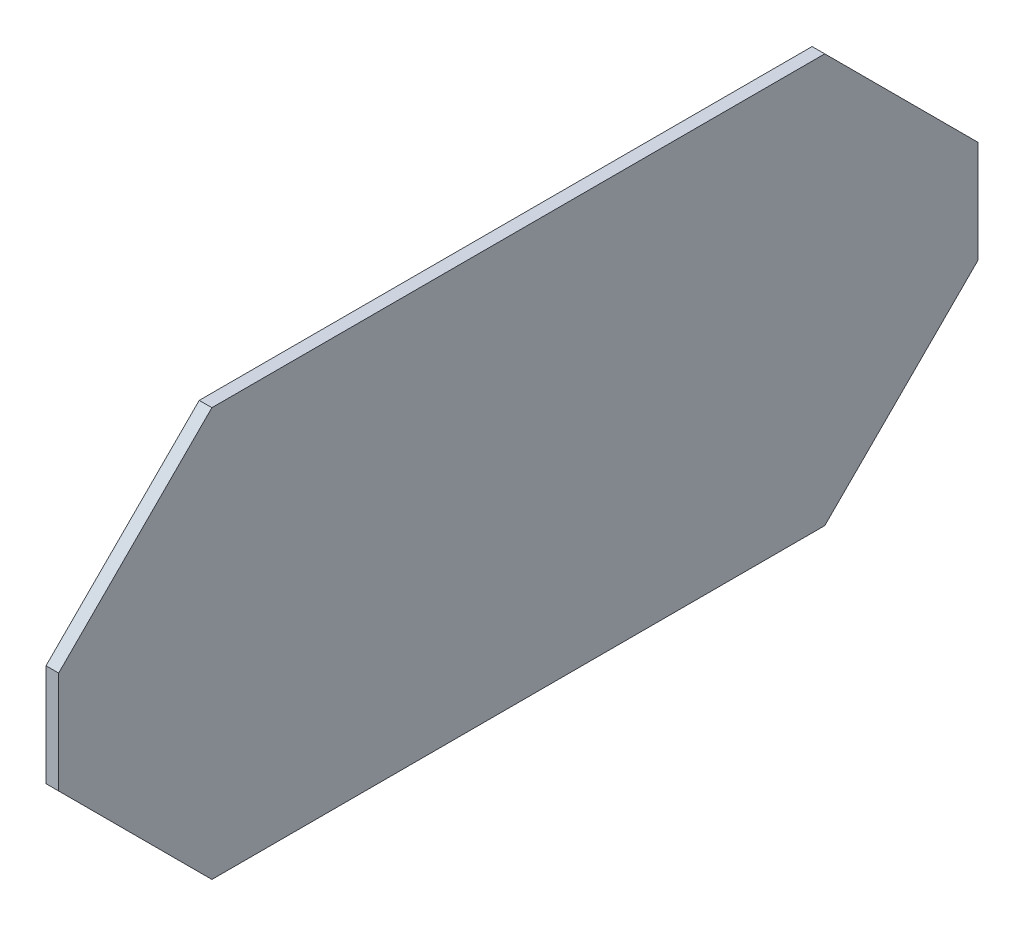
ISO-10303-21;
HEADER;
FILE_DESCRIPTION(('STEP AP214'),'2;1');
FILE_NAME('part.step','',(''),(''),'','','');
FILE_SCHEMA(('AUTOMOTIVE_DESIGN { 1 0 10303 214 1 1 1 1 }'));
ENDSEC;
DATA;
#1=APPLICATION_CONTEXT('core data for automotive mechanical design processes');
#2=APPLICATION_PROTOCOL_DEFINITION('international standard','automotive_design',2000,#1);
#3=PRODUCT_CONTEXT('',#1,'mechanical');
#4=PRODUCT('Part','Part','',(#3));
#5=PRODUCT_RELATED_PRODUCT_CATEGORY('part','',(#4));
#6=PRODUCT_DEFINITION_FORMATION('','',#4);
#7=PRODUCT_DEFINITION_CONTEXT('part definition',#1,'design');
#8=PRODUCT_DEFINITION('design','',#6,#7);
#9=PRODUCT_DEFINITION_SHAPE('','',#8);
#10=(LENGTH_UNIT() NAMED_UNIT(*) SI_UNIT(.MILLI.,.METRE.));
#11=(NAMED_UNIT(*) PLANE_ANGLE_UNIT() SI_UNIT($,.RADIAN.));
#12=(NAMED_UNIT(*) SI_UNIT($,.STERADIAN.) SOLID_ANGLE_UNIT());
#13=UNCERTAINTY_MEASURE_WITH_UNIT(LENGTH_MEASURE(1.E-05),#10,'distance_accuracy_value','');
#14=(GEOMETRIC_REPRESENTATION_CONTEXT(3) GLOBAL_UNCERTAINTY_ASSIGNED_CONTEXT((#13)) GLOBAL_UNIT_ASSIGNED_CONTEXT((#10,
#11,#12)) REPRESENTATION_CONTEXT('',''));
#15=CARTESIAN_POINT('',(0.,0.,0.));
#16=DIRECTION('',(0.,0.,1.));
#17=DIRECTION('',(1.,0.,0.));
#18=AXIS2_PLACEMENT_3D('',#15,#16,#17);
#19=CARTESIAN_POINT('',(0.393699999999998,12.7,28.575));
#20=DIRECTION('',(-1.,0.,0.));
#21=DIRECTION('',(0.,-1.,0.));
#22=AXIS2_PLACEMENT_3D('',#19,#20,#21);
#23=PLANE('',#22);
#24=DIRECTION('',(0.,1.,0.));
#25=VECTOR('',#24,1.);
#26=CARTESIAN_POINT('',(0.393699999999998,12.7,-28.575));
#27=LINE('',#26,#25);
#28=CARTESIAN_POINT('',(0.3937,-3.17499999999996,-28.575));
#29=VERTEX_POINT('',#28);
#30=CARTESIAN_POINT('',(0.3937,3.17499999999997,-28.575));
#31=VERTEX_POINT('',#30);
#32=EDGE_CURVE('E159',#29,#31,#27,.T.);
#33=ORIENTED_EDGE('',*,*,#32,.T.);
#34=DIRECTION('',(0.,-0.707106781186549,-0.707106781186546));
#35=VECTOR('',#34,1.);
#36=CARTESIAN_POINT('',(0.393699999999998,12.7,-19.05));
#37=LINE('',#36,#35);
#38=CARTESIAN_POINT('',(0.393699999999998,12.7,-19.05));
#39=VERTEX_POINT('',#38);
#40=EDGE_CURVE('E144',#31,#39,#37,.F.);
#41=ORIENTED_EDGE('',*,*,#40,.T.);
#42=DIRECTION('',(0.,0.,-1.));
#43=VECTOR('',#42,1.);
#44=CARTESIAN_POINT('',(0.393699999999998,12.7,28.575));
#45=LINE('',#44,#43);
#46=CARTESIAN_POINT('',(0.393699999999998,12.7,19.05));
#47=VERTEX_POINT('',#46);
#48=EDGE_CURVE('E123',#47,#39,#45,.T.);
#49=ORIENTED_EDGE('',*,*,#48,.F.);
#50=DIRECTION('',(0.,-0.707106781186546,0.707106781186549));
#51=VECTOR('',#50,1.);
#52=CARTESIAN_POINT('',(0.3937,3.175,28.575));
#53=LINE('',#52,#51);
#54=CARTESIAN_POINT('',(0.3937,3.175,28.575));
#55=VERTEX_POINT('',#54);
#56=EDGE_CURVE('E127',#47,#55,#53,.T.);
#57=ORIENTED_EDGE('',*,*,#56,.T.);
#58=DIRECTION('',(0.,1.,0.));
#59=VECTOR('',#58,1.);
#60=CARTESIAN_POINT('',(0.393699999999998,12.7,28.575));
#61=LINE('',#60,#59);
#62=CARTESIAN_POINT('',(0.3937,-3.17499999999999,28.575));
#63=VERTEX_POINT('',#62);
#64=EDGE_CURVE('E153',#63,#55,#61,.T.);
#65=ORIENTED_EDGE('',*,*,#64,.F.);
#66=DIRECTION('',(0.,-0.707106781186546,-0.707106781186549));
#67=VECTOR('',#66,1.);
#68=CARTESIAN_POINT('',(0.3937,-3.17499999999999,28.575));
#69=LINE('',#68,#67);
#70=CARTESIAN_POINT('',(0.393700000000002,-12.7,19.05));
#71=VERTEX_POINT('',#70);
#72=EDGE_CURVE('E59',#63,#71,#69,.T.);
#73=ORIENTED_EDGE('',*,*,#72,.T.);
#74=DIRECTION('',(0.,0.,-1.));
#75=VECTOR('',#74,1.);
#76=CARTESIAN_POINT('',(0.393700000000002,-12.7,28.575));
#77=LINE('',#76,#75);
#78=CARTESIAN_POINT('',(0.393700000000002,-12.7,-19.05));
#79=VERTEX_POINT('',#78);
#80=EDGE_CURVE('E156',#71,#79,#77,.T.);
#81=ORIENTED_EDGE('',*,*,#80,.T.);
#82=DIRECTION('',(0.,-0.707106781186549,0.707106781186546));
#83=VECTOR('',#82,1.);
#84=CARTESIAN_POINT('',(0.393700000000002,-12.7,-19.05));
#85=LINE('',#84,#83);
#86=EDGE_CURVE('E51',#79,#29,#85,.F.);
#87=ORIENTED_EDGE('',*,*,#86,.T.);
#88=EDGE_LOOP('',(#33,#41,#49,#57,#65,#73,#81,#87));
#89=FACE_BOUND('',#88,.T.);
#90=ADVANCED_FACE('F35',(#89),#23,.F.);
#91=CARTESIAN_POINT('',(-0.393700000000001,12.7,28.575));
#92=DIRECTION('',(0.,-1.,0.));
#93=DIRECTION('',(0.,0.,-1.));
#94=AXIS2_PLACEMENT_3D('',#91,#92,#93);
#95=PLANE('',#94);
#96=ORIENTED_EDGE('',*,*,#48,.T.);
#97=DIRECTION('',(-1.,0.,0.));
#98=VECTOR('',#97,1.);
#99=CARTESIAN_POINT('',(-0.393700000000001,12.7,-19.05));
#100=LINE('',#99,#98);
#101=CARTESIAN_POINT('',(-0.393700000000001,12.7,-19.05));
#102=VERTEX_POINT('',#101);
#103=EDGE_CURVE('E114',#39,#102,#100,.T.);
#104=ORIENTED_EDGE('',*,*,#103,.T.);
#105=DIRECTION('',(0.,0.,-1.));
#106=VECTOR('',#105,1.);
#107=CARTESIAN_POINT('',(-0.393700000000001,12.7,28.575));
#108=LINE('',#107,#106);
#109=CARTESIAN_POINT('',(-0.393700000000001,12.7,19.05));
#110=VERTEX_POINT('',#109);
#111=EDGE_CURVE('E106',#110,#102,#108,.T.);
#112=ORIENTED_EDGE('',*,*,#111,.F.);
#113=DIRECTION('',(1.,0.,0.));
#114=VECTOR('',#113,1.);
#115=CARTESIAN_POINT('',(0.393699999999998,12.7,19.05));
#116=LINE('',#115,#114);
#117=EDGE_CURVE('E120',#110,#47,#116,.T.);
#118=ORIENTED_EDGE('',*,*,#117,.T.);
#119=EDGE_LOOP('',(#96,#104,#112,#118));
#120=FACE_BOUND('',#119,.T.);
#121=ADVANCED_FACE('F119',(#120),#95,.F.);
#122=CARTESIAN_POINT('',(-0.393700000000001,12.7,28.575));
#123=DIRECTION('',(1.,0.,0.));
#124=DIRECTION('',(0.,1.,0.));
#125=AXIS2_PLACEMENT_3D('',#122,#123,#124);
#126=PLANE('',#125);
#127=ORIENTED_EDGE('',*,*,#111,.T.);
#128=DIRECTION('',(0.,0.707106781186549,0.707106781186546));
#129=VECTOR('',#128,1.);
#130=CARTESIAN_POINT('',(-0.393700000000001,12.7,-19.05));
#131=LINE('',#130,#129);
#132=CARTESIAN_POINT('',(-0.3937,3.17499999999997,-28.575));
#133=VERTEX_POINT('',#132);
#134=EDGE_CURVE('E135',#102,#133,#131,.F.);
#135=ORIENTED_EDGE('',*,*,#134,.T.);
#136=DIRECTION('',(0.,-1.,0.));
#137=VECTOR('',#136,1.);
#138=CARTESIAN_POINT('',(-0.393700000000001,12.7,-28.575));
#139=LINE('',#138,#137);
#140=CARTESIAN_POINT('',(-0.3937,-3.17499999999996,-28.575));
#141=VERTEX_POINT('',#140);
#142=EDGE_CURVE('E154',#133,#141,#139,.T.);
#143=ORIENTED_EDGE('',*,*,#142,.T.);
#144=DIRECTION('',(0.,0.707106781186549,-0.707106781186546));
#145=VECTOR('',#144,1.);
#146=CARTESIAN_POINT('',(-0.393699999999998,-12.7,-19.05));
#147=LINE('',#146,#145);
#148=CARTESIAN_POINT('',(-0.393699999999998,-12.7,-19.05));
#149=VERTEX_POINT('',#148);
#150=EDGE_CURVE('E133',#141,#149,#147,.F.);
#151=ORIENTED_EDGE('',*,*,#150,.T.);
#152=DIRECTION('',(0.,0.,-1.));
#153=VECTOR('',#152,1.);
#154=CARTESIAN_POINT('',(-0.393699999999998,-12.7,28.575));
#155=LINE('',#154,#153);
#156=CARTESIAN_POINT('',(-0.393699999999998,-12.7,19.05));
#157=VERTEX_POINT('',#156);
#158=EDGE_CURVE('E124',#157,#149,#155,.T.);
#159=ORIENTED_EDGE('',*,*,#158,.F.);
#160=DIRECTION('',(0.,0.707106781186546,0.707106781186549));
#161=VECTOR('',#160,1.);
#162=CARTESIAN_POINT('',(-0.3937,-3.17499999999999,28.575));
#163=LINE('',#162,#161);
#164=CARTESIAN_POINT('',(-0.3937,-3.17499999999999,28.575));
#165=VERTEX_POINT('',#164);
#166=EDGE_CURVE('E113',#157,#165,#163,.T.);
#167=ORIENTED_EDGE('',*,*,#166,.T.);
#168=DIRECTION('',(0.,-1.,0.));
#169=VECTOR('',#168,1.);
#170=CARTESIAN_POINT('',(-0.393700000000001,12.7,28.575));
#171=LINE('',#170,#169);
#172=CARTESIAN_POINT('',(-0.3937,3.175,28.575));
#173=VERTEX_POINT('',#172);
#174=EDGE_CURVE('E108',#173,#165,#171,.T.);
#175=ORIENTED_EDGE('',*,*,#174,.F.);
#176=DIRECTION('',(0.,0.707106781186546,-0.707106781186549));
#177=VECTOR('',#176,1.);
#178=CARTESIAN_POINT('',(-0.3937,3.175,28.575));
#179=LINE('',#178,#177);
#180=EDGE_CURVE('E103',#173,#110,#179,.T.);
#181=ORIENTED_EDGE('',*,*,#180,.T.);
#182=EDGE_LOOP('',(#127,#135,#143,#151,#159,#167,#175,#181));
#183=FACE_BOUND('',#182,.T.);
#184=ADVANCED_FACE('F105',(#183),#126,.F.);
#185=CARTESIAN_POINT('',(-0.393699999999998,-12.7,28.575));
#186=DIRECTION('',(0.,1.,0.));
#187=DIRECTION('',(0.,0.,1.));
#188=AXIS2_PLACEMENT_3D('',#185,#186,#187);
#189=PLANE('',#188);
#190=ORIENTED_EDGE('',*,*,#158,.T.);
#191=DIRECTION('',(1.,0.,0.));
#192=VECTOR('',#191,1.);
#193=CARTESIAN_POINT('',(-0.393699999999998,-12.7,-19.05));
#194=LINE('',#193,#192);
#195=EDGE_CURVE('E148',#149,#79,#194,.T.);
#196=ORIENTED_EDGE('',*,*,#195,.T.);
#197=ORIENTED_EDGE('',*,*,#80,.F.);
#198=DIRECTION('',(-1.,0.,0.));
#199=VECTOR('',#198,1.);
#200=CARTESIAN_POINT('',(-0.393699999999998,-12.7,19.05));
#201=LINE('',#200,#199);
#202=EDGE_CURVE('E146',#71,#157,#201,.T.);
#203=ORIENTED_EDGE('',*,*,#202,.T.);
#204=EDGE_LOOP('',(#190,#196,#197,#203));
#205=FACE_BOUND('',#204,.T.);
#206=ADVANCED_FACE('F168',(#205),#189,.F.);
#207=CARTESIAN_POINT('',(0.,0.,28.575));
#208=DIRECTION('',(0.,0.,1.));
#209=DIRECTION('',(1.,0.,0.));
#210=AXIS2_PLACEMENT_3D('',#207,#208,#209);
#211=PLANE('',#210);
#212=ORIENTED_EDGE('',*,*,#174,.T.);
#213=DIRECTION('',(1.,0.,0.));
#214=VECTOR('',#213,1.);
#215=CARTESIAN_POINT('',(0.393700000000002,-3.17499999999999,28.575));
#216=LINE('',#215,#214);
#217=EDGE_CURVE('E11',#165,#63,#216,.T.);
#218=ORIENTED_EDGE('',*,*,#217,.T.);
#219=ORIENTED_EDGE('',*,*,#64,.T.);
#220=DIRECTION('',(-1.,0.,0.));
#221=VECTOR('',#220,1.);
#222=CARTESIAN_POINT('',(-0.393700000000001,3.175,28.575));
#223=LINE('',#222,#221);
#224=EDGE_CURVE('E44',#55,#173,#223,.T.);
#225=ORIENTED_EDGE('',*,*,#224,.T.);
#226=EDGE_LOOP('',(#212,#218,#219,#225));
#227=FACE_BOUND('',#226,.T.);
#228=ADVANCED_FACE('F151',(#227),#211,.T.);
#229=CARTESIAN_POINT('',(0.,0.,-28.575));
#230=DIRECTION('',(0.,0.,1.));
#231=DIRECTION('',(1.,0.,0.));
#232=AXIS2_PLACEMENT_3D('',#229,#230,#231);
#233=PLANE('',#232);
#234=ORIENTED_EDGE('',*,*,#142,.F.);
#235=DIRECTION('',(1.,0.,0.));
#236=VECTOR('',#235,1.);
#237=CARTESIAN_POINT('',(0.,3.17499999999997,-28.575));
#238=LINE('',#237,#236);
#239=EDGE_CURVE('E139',#133,#31,#238,.T.);
#240=ORIENTED_EDGE('',*,*,#239,.T.);
#241=ORIENTED_EDGE('',*,*,#32,.F.);
#242=DIRECTION('',(-1.,0.,0.));
#243=VECTOR('',#242,1.);
#244=CARTESIAN_POINT('',(0.,-3.17499999999996,-28.575));
#245=LINE('',#244,#243);
#246=EDGE_CURVE('E137',#29,#141,#245,.T.);
#247=ORIENTED_EDGE('',*,*,#246,.T.);
#248=EDGE_LOOP('',(#234,#240,#241,#247));
#249=FACE_BOUND('',#248,.T.);
#250=ADVANCED_FACE('F176',(#249),#233,.F.);
#251=CARTESIAN_POINT('',(-0.393700000000001,12.7,-19.05));
#252=DIRECTION('',(0.,-0.707106781186546,0.707106781186549));
#253=DIRECTION('',(-1.,0.,0.));
#254=AXIS2_PLACEMENT_3D('',#251,#252,#253);
#255=PLANE('',#254);
#256=ORIENTED_EDGE('',*,*,#40,.F.);
#257=ORIENTED_EDGE('',*,*,#239,.F.);
#258=ORIENTED_EDGE('',*,*,#134,.F.);
#259=ORIENTED_EDGE('',*,*,#103,.F.);
#260=EDGE_LOOP('',(#256,#257,#258,#259));
#261=FACE_BOUND('',#260,.T.);
#262=ADVANCED_FACE('F180',(#261),#255,.F.);
#263=CARTESIAN_POINT('',(-0.393699999999998,-12.7,-19.05));
#264=DIRECTION('',(0.,0.707106781186546,0.707106781186549));
#265=DIRECTION('',(1.,0.,0.));
#266=AXIS2_PLACEMENT_3D('',#263,#264,#265);
#267=PLANE('',#266);
#268=ORIENTED_EDGE('',*,*,#150,.F.);
#269=ORIENTED_EDGE('',*,*,#246,.F.);
#270=ORIENTED_EDGE('',*,*,#86,.F.);
#271=ORIENTED_EDGE('',*,*,#195,.F.);
#272=EDGE_LOOP('',(#268,#269,#270,#271));
#273=FACE_BOUND('',#272,.T.);
#274=ADVANCED_FACE('F172',(#273),#267,.F.);
#275=CARTESIAN_POINT('',(0.,-3.17499999999999,28.575));
#276=DIRECTION('',(0.,-0.707106781186549,0.707106781186546));
#277=DIRECTION('',(-1.,0.,0.));
#278=AXIS2_PLACEMENT_3D('',#275,#276,#277);
#279=PLANE('',#278);
#280=ORIENTED_EDGE('',*,*,#166,.F.);
#281=ORIENTED_EDGE('',*,*,#202,.F.);
#282=ORIENTED_EDGE('',*,*,#72,.F.);
#283=ORIENTED_EDGE('',*,*,#217,.F.);
#284=EDGE_LOOP('',(#280,#281,#282,#283));
#285=FACE_BOUND('',#284,.T.);
#286=ADVANCED_FACE('F182',(#285),#279,.T.);
#287=CARTESIAN_POINT('',(0.,3.175,28.575));
#288=DIRECTION('',(0.,0.707106781186549,0.707106781186546));
#289=DIRECTION('',(1.,0.,0.));
#290=AXIS2_PLACEMENT_3D('',#287,#288,#289);
#291=PLANE('',#290);
#292=ORIENTED_EDGE('',*,*,#56,.F.);
#293=ORIENTED_EDGE('',*,*,#117,.F.);
#294=ORIENTED_EDGE('',*,*,#180,.F.);
#295=ORIENTED_EDGE('',*,*,#224,.F.);
#296=EDGE_LOOP('',(#292,#293,#294,#295));
#297=FACE_BOUND('',#296,.T.);
#298=ADVANCED_FACE('F38',(#297),#291,.T.);
#299=CLOSED_SHELL('',(#90,#121,#184,#206,#228,#250,#262,#274,#286,#298));
#300=MANIFOLD_SOLID_BREP('B2',#299);
#301=ADVANCED_BREP_SHAPE_REPRESENTATION('',(#18,#300),#14);
#302=SHAPE_DEFINITION_REPRESENTATION(#9,#301);
ENDSEC;
END-ISO-10303-21;
